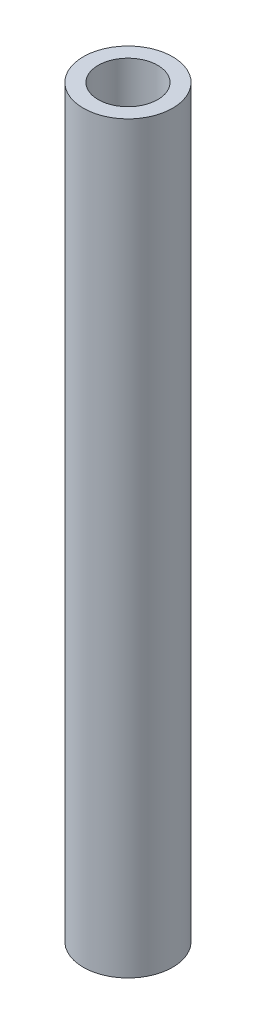
ISO-10303-21;
HEADER;
FILE_DESCRIPTION(('STEP AP214'),'2;1');
FILE_NAME('part.step','',(''),(''),'','','');
FILE_SCHEMA(('AUTOMOTIVE_DESIGN { 1 0 10303 214 1 1 1 1 }'));
ENDSEC;
DATA;
#1=APPLICATION_CONTEXT('core data for automotive mechanical design processes');
#2=APPLICATION_PROTOCOL_DEFINITION('international standard','automotive_design',2000,#1);
#3=PRODUCT_CONTEXT('',#1,'mechanical');
#4=PRODUCT('Part','Part','',(#3));
#5=PRODUCT_RELATED_PRODUCT_CATEGORY('part','',(#4));
#6=PRODUCT_DEFINITION_FORMATION('','',#4);
#7=PRODUCT_DEFINITION_CONTEXT('part definition',#1,'design');
#8=PRODUCT_DEFINITION('design','',#6,#7);
#9=PRODUCT_DEFINITION_SHAPE('','',#8);
#10=(LENGTH_UNIT() NAMED_UNIT(*) SI_UNIT(.MILLI.,.METRE.));
#11=(NAMED_UNIT(*) PLANE_ANGLE_UNIT() SI_UNIT($,.RADIAN.));
#12=(NAMED_UNIT(*) SI_UNIT($,.STERADIAN.) SOLID_ANGLE_UNIT());
#13=UNCERTAINTY_MEASURE_WITH_UNIT(LENGTH_MEASURE(1.E-05),#10,'distance_accuracy_value','');
#14=(GEOMETRIC_REPRESENTATION_CONTEXT(3) GLOBAL_UNCERTAINTY_ASSIGNED_CONTEXT((#13)) GLOBAL_UNIT_ASSIGNED_CONTEXT((#10,
#11,#12)) REPRESENTATION_CONTEXT('',''));
#15=CARTESIAN_POINT('',(0.,0.,0.));
#16=DIRECTION('',(0.,0.,1.));
#17=DIRECTION('',(1.,0.,0.));
#18=AXIS2_PLACEMENT_3D('',#15,#16,#17);
#19=CARTESIAN_POINT('',(0.,50.,0.));
#20=DIRECTION('',(0.,1.,0.));
#21=DIRECTION('',(0.,0.,1.));
#22=AXIS2_PLACEMENT_3D('',#19,#20,#21);
#23=PLANE('',#22);
#24=CARTESIAN_POINT('',(0.,50.,0.));
#25=DIRECTION('',(0.,1.,0.));
#26=DIRECTION('',(0.,0.,1.));
#27=AXIS2_PLACEMENT_3D('',#24,#25,#26);
#28=CIRCLE('',#27,3.);
#29=CARTESIAN_POINT('',(0.,50.,3.));
#30=VERTEX_POINT('',#29);
#31=EDGE_CURVE('E10',#30,#30,#28,.T.);
#32=ORIENTED_EDGE('',*,*,#31,.T.);
#33=EDGE_LOOP('',(#32));
#34=FACE_BOUND('',#33,.T.);
#35=CARTESIAN_POINT('',(0.,50.,0.));
#36=DIRECTION('',(0.,1.,0.));
#37=DIRECTION('',(0.,0.,1.));
#38=AXIS2_PLACEMENT_3D('',#35,#36,#37);
#39=CIRCLE('',#38,2.);
#40=CARTESIAN_POINT('',(0.,50.,2.));
#41=VERTEX_POINT('',#40);
#42=EDGE_CURVE('E42',#41,#41,#39,.T.);
#43=ORIENTED_EDGE('',*,*,#42,.F.);
#44=EDGE_LOOP('',(#43));
#45=FACE_BOUND('',#44,.T.);
#46=ADVANCED_FACE('F31',(#34,#45),#23,.T.);
#47=CARTESIAN_POINT('',(0.,0.,0.));
#48=DIRECTION('',(0.,1.,0.));
#49=DIRECTION('',(0.,0.,1.));
#50=AXIS2_PLACEMENT_3D('',#47,#48,#49);
#51=PLANE('',#50);
#52=CARTESIAN_POINT('',(0.,0.,0.));
#53=DIRECTION('',(0.,1.,0.));
#54=DIRECTION('',(0.,0.,1.));
#55=AXIS2_PLACEMENT_3D('',#52,#53,#54);
#56=CIRCLE('',#55,3.);
#57=CARTESIAN_POINT('',(0.,0.,3.));
#58=VERTEX_POINT('',#57);
#59=EDGE_CURVE('E35',#58,#58,#56,.T.);
#60=ORIENTED_EDGE('',*,*,#59,.F.);
#61=EDGE_LOOP('',(#60));
#62=FACE_BOUND('',#61,.T.);
#63=CARTESIAN_POINT('',(0.,0.,0.));
#64=DIRECTION('',(0.,1.,0.));
#65=DIRECTION('',(0.,0.,1.));
#66=AXIS2_PLACEMENT_3D('',#63,#64,#65);
#67=CIRCLE('',#66,2.);
#68=CARTESIAN_POINT('',(0.,0.,2.));
#69=VERTEX_POINT('',#68);
#70=EDGE_CURVE('E44',#69,#69,#67,.T.);
#71=ORIENTED_EDGE('',*,*,#70,.T.);
#72=EDGE_LOOP('',(#71));
#73=FACE_BOUND('',#72,.T.);
#74=ADVANCED_FACE('F54',(#62,#73),#51,.F.);
#75=CARTESIAN_POINT('',(0.,50.,0.));
#76=DIRECTION('',(0.,-1.,0.));
#77=DIRECTION('',(0.,0.,-1.));
#78=AXIS2_PLACEMENT_3D('',#75,#76,#77);
#79=CYLINDRICAL_SURFACE('',#78,3.);
#80=ORIENTED_EDGE('',*,*,#31,.F.);
#81=EDGE_LOOP('',(#80));
#82=FACE_BOUND('',#81,.T.);
#83=ORIENTED_EDGE('',*,*,#59,.T.);
#84=EDGE_LOOP('',(#83));
#85=FACE_BOUND('',#84,.T.);
#86=ADVANCED_FACE('F33',(#82,#85),#79,.T.);
#87=CARTESIAN_POINT('',(0.,50.,0.));
#88=DIRECTION('',(0.,-1.,0.));
#89=DIRECTION('',(0.,0.,-1.));
#90=AXIS2_PLACEMENT_3D('',#87,#88,#89);
#91=CYLINDRICAL_SURFACE('',#90,2.);
#92=ORIENTED_EDGE('',*,*,#42,.T.);
#93=EDGE_LOOP('',(#92));
#94=FACE_BOUND('',#93,.T.);
#95=ORIENTED_EDGE('',*,*,#70,.F.);
#96=EDGE_LOOP('',(#95));
#97=FACE_BOUND('',#96,.T.);
#98=ADVANCED_FACE('F50',(#94,#97),#91,.F.);
#99=CLOSED_SHELL('',(#46,#74,#86,#98));
#100=MANIFOLD_SOLID_BREP('B2',#99);
#101=ADVANCED_BREP_SHAPE_REPRESENTATION('',(#18,#100),#14);
#102=SHAPE_DEFINITION_REPRESENTATION(#9,#101);
ENDSEC;
END-ISO-10303-21;
